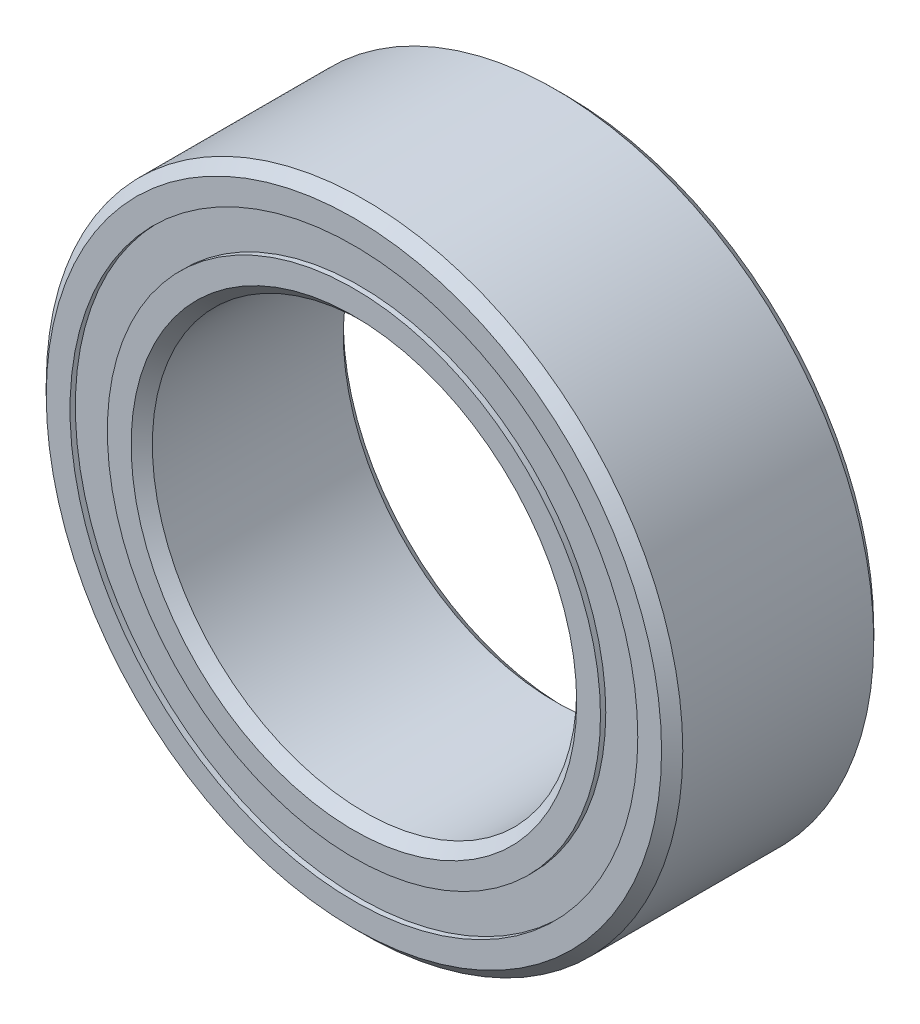
ISO-10303-21;
HEADER;
FILE_DESCRIPTION(('STEP AP214'),'2;1');
FILE_NAME('part.step','',(''),(''),'','','');
FILE_SCHEMA(('AUTOMOTIVE_DESIGN { 1 0 10303 214 1 1 1 1 }'));
ENDSEC;
DATA;
#1=APPLICATION_CONTEXT('core data for automotive mechanical design processes');
#2=APPLICATION_PROTOCOL_DEFINITION('international standard','automotive_design',2000,#1);
#3=PRODUCT_CONTEXT('',#1,'mechanical');
#4=PRODUCT('Part','Part','',(#3));
#5=PRODUCT_RELATED_PRODUCT_CATEGORY('part','',(#4));
#6=PRODUCT_DEFINITION_FORMATION('','',#4);
#7=PRODUCT_DEFINITION_CONTEXT('part definition',#1,'design');
#8=PRODUCT_DEFINITION('design','',#6,#7);
#9=PRODUCT_DEFINITION_SHAPE('','',#8);
#10=(LENGTH_UNIT() NAMED_UNIT(*) SI_UNIT(.MILLI.,.METRE.));
#11=(NAMED_UNIT(*) PLANE_ANGLE_UNIT() SI_UNIT($,.RADIAN.));
#12=(NAMED_UNIT(*) SI_UNIT($,.STERADIAN.) SOLID_ANGLE_UNIT());
#13=UNCERTAINTY_MEASURE_WITH_UNIT(LENGTH_MEASURE(1.E-05),#10,'distance_accuracy_value','');
#14=(GEOMETRIC_REPRESENTATION_CONTEXT(3) GLOBAL_UNCERTAINTY_ASSIGNED_CONTEXT((#13)) GLOBAL_UNIT_ASSIGNED_CONTEXT((#10,
#11,#12)) REPRESENTATION_CONTEXT('',''));
#15=CARTESIAN_POINT('',(0.,0.,0.));
#16=DIRECTION('',(0.,0.,1.));
#17=DIRECTION('',(1.,0.,0.));
#18=AXIS2_PLACEMENT_3D('',#15,#16,#17);
#19=CARTESIAN_POINT('',(0.,4.24787087912088,-1.508125));
#20=DIRECTION('',(0.,0.,1.));
#21=DIRECTION('',(1.,0.,0.));
#22=AXIS2_PLACEMENT_3D('',#19,#20,#21);
#23=PLANE('',#22);
#24=CARTESIAN_POINT('',(0.,0.,-1.508125));
#25=DIRECTION('',(0.,0.,1.));
#26=DIRECTION('',(1.,0.,0.));
#27=AXIS2_PLACEMENT_3D('',#24,#25,#26);
#28=CIRCLE('',#27,3.68962912087912);
#29=CARTESIAN_POINT('',(3.68962912087912,0.,-1.508125));
#30=VERTEX_POINT('',#29);
#31=EDGE_CURVE('P0_E17',#30,#30,#28,.T.);
#32=ORIENTED_EDGE('',*,*,#31,.T.);
#33=EDGE_LOOP('',(#32));
#34=FACE_BOUND('',#33,.T.);
#35=CARTESIAN_POINT('',(0.,0.,-1.508125));
#36=DIRECTION('',(0.,0.,1.));
#37=DIRECTION('',(1.,0.,0.));
#38=AXIS2_PLACEMENT_3D('',#35,#36,#37);
#39=CIRCLE('',#38,4.24787087912088);
#40=CARTESIAN_POINT('',(4.24787087912088,0.,-1.508125));
#41=VERTEX_POINT('',#40);
#42=EDGE_CURVE('P0_E26',#41,#41,#39,.T.);
#43=ORIENTED_EDGE('',*,*,#42,.F.);
#44=EDGE_LOOP('',(#43));
#45=FACE_BOUND('',#44,.T.);
#46=ADVANCED_FACE('P0_F14',(#34,#45),#23,.F.);
#47=CARTESIAN_POINT('',(0.,0.,1.5875));
#48=DIRECTION('',(0.,0.,1.));
#49=DIRECTION('',(1.,0.,0.));
#50=AXIS2_PLACEMENT_3D('',#47,#48,#49);
#51=CYLINDRICAL_SURFACE('',#50,3.68962912087912);
#52=ORIENTED_EDGE('',*,*,#31,.F.);
#53=EDGE_LOOP('',(#52));
#54=FACE_BOUND('',#53,.T.);
#55=CARTESIAN_POINT('',(0.,0.,-0.758760243513405));
#56=DIRECTION('',(0.,0.,1.));
#57=DIRECTION('',(1.,0.,0.));
#58=AXIS2_PLACEMENT_3D('',#55,#56,#57);
#59=CIRCLE('',#58,3.68962912087912);
#60=CARTESIAN_POINT('',(3.68962912087912,0.,-0.758760243513405));
#61=VERTEX_POINT('',#60);
#62=EDGE_CURVE('P0_E21',#61,#61,#59,.T.);
#63=ORIENTED_EDGE('',*,*,#62,.T.);
#64=EDGE_LOOP('',(#63));
#65=FACE_BOUND('',#64,.T.);
#66=ADVANCED_FACE('P0_F36',(#54,#65),#51,.F.);
#67=CARTESIAN_POINT('',(0.,0.,1.5875));
#68=DIRECTION('',(0.,0.,1.));
#69=DIRECTION('',(1.,0.,0.));
#70=AXIS2_PLACEMENT_3D('',#67,#68,#69);
#71=CYLINDRICAL_SURFACE('',#70,4.24787087912088);
#72=CARTESIAN_POINT('',(0.,0.,-0.758760243513404));
#73=DIRECTION('',(0.,0.,1.));
#74=DIRECTION('',(1.,0.,0.));
#75=AXIS2_PLACEMENT_3D('',#72,#73,#74);
#76=CIRCLE('',#75,4.24787087912088);
#77=CARTESIAN_POINT('',(4.24787087912088,0.,-0.758760243513404));
#78=VERTEX_POINT('',#77);
#79=EDGE_CURVE('P0_E10',#78,#78,#76,.F.);
#80=ORIENTED_EDGE('',*,*,#79,.T.);
#81=EDGE_LOOP('',(#80));
#82=FACE_BOUND('',#81,.T.);
#83=ORIENTED_EDGE('',*,*,#42,.T.);
#84=EDGE_LOOP('',(#83));
#85=FACE_BOUND('',#84,.T.);
#86=ADVANCED_FACE('P0_F39',(#82,#85),#71,.T.);
#87=CARTESIAN_POINT('',(0.,4.24787087912088,-0.758760243513404));
#88=DIRECTION('',(0.,0.,-1.));
#89=DIRECTION('',(-1.,0.,0.));
#90=AXIS2_PLACEMENT_3D('',#87,#88,#89);
#91=PLANE('',#90);
#92=ORIENTED_EDGE('',*,*,#79,.F.);
#93=EDGE_LOOP('',(#92));
#94=FACE_BOUND('',#93,.T.);
#95=ORIENTED_EDGE('',*,*,#62,.F.);
#96=EDGE_LOOP('',(#95));
#97=FACE_BOUND('',#96,.T.);
#98=ADVANCED_FACE('P0_F42',(#94,#97),#91,.F.);
#99=CLOSED_SHELL('',(#46,#66,#86,#98));
#100=MANIFOLD_SOLID_BREP('P0_B1',#99);
#101=CARTESIAN_POINT('',(0.,3.96875,0.));
#102=DIRECTION('',(0.,1.,0.));
#103=DIRECTION('',(0.,0.,-1.));
#104=AXIS2_PLACEMENT_3D('',#101,#102,#103);
#105=SPHERICAL_SURFACE('',#104,0.758760243513404);
#106=CARTESIAN_POINT('',(0.,3.2099897564866,0.));
#107=VERTEX_POINT('',#106);
#108=VERTEX_LOOP('',#107);
#109=FACE_BOUND('',#108,.T.);
#110=CARTESIAN_POINT('',(0.,4.7275102435134,0.));
#111=VERTEX_POINT('',#110);
#112=VERTEX_LOOP('',#111);
#113=FACE_BOUND('',#112,.T.);
#114=ADVANCED_FACE('P1_F15',(#109,#113),#105,.T.);
#115=CLOSED_SHELL('',(#114));
#116=MANIFOLD_SOLID_BREP('P1_B1',#115);
#117=CARTESIAN_POINT('',(0.,-3.96875,0.));
#118=DIRECTION('',(0.,-1.,0.));
#119=DIRECTION('',(0.,0.,-1.));
#120=AXIS2_PLACEMENT_3D('',#117,#118,#119);
#121=SPHERICAL_SURFACE('',#120,0.758760243513404);
#122=CARTESIAN_POINT('',(0.,-3.2099897564866,0.));
#123=VERTEX_POINT('',#122);
#124=VERTEX_LOOP('',#123);
#125=FACE_BOUND('',#124,.T.);
#126=CARTESIAN_POINT('',(0.,-4.7275102435134,0.));
#127=VERTEX_POINT('',#126);
#128=VERTEX_LOOP('',#127);
#129=FACE_BOUND('',#128,.T.);
#130=ADVANCED_FACE('P2_F15',(#125,#129),#121,.T.);
#131=CLOSED_SHELL('',(#130));
#132=MANIFOLD_SOLID_BREP('P2_B1',#131);
#133=CARTESIAN_POINT('',(-3.43703832126947,1.98437500000004,0.));
#134=DIRECTION('',(-0.866025403784433,0.50000000000001,0.));
#135=DIRECTION('',(0.,0.,-1.));
#136=AXIS2_PLACEMENT_3D('',#133,#134,#135);
#137=SPHERICAL_SURFACE('',#136,0.758760243513404);
#138=CARTESIAN_POINT('',(-2.7799326750052,1.60499487824333,0.));
#139=VERTEX_POINT('',#138);
#140=VERTEX_LOOP('',#139);
#141=FACE_BOUND('',#140,.T.);
#142=CARTESIAN_POINT('',(-4.09414396753374,2.36375512175675,0.));
#143=VERTEX_POINT('',#142);
#144=VERTEX_LOOP('',#143);
#145=FACE_BOUND('',#144,.T.);
#146=ADVANCED_FACE('P3_F15',(#141,#145),#137,.T.);
#147=CLOSED_SHELL('',(#146));
#148=MANIFOLD_SOLID_BREP('P3_B1',#147);
#149=CARTESIAN_POINT('',(3.43703832126948,-1.98437500000002,0.));
#150=DIRECTION('',(0.866025403784437,-0.500000000000004,0.));
#151=DIRECTION('',(0.,0.,-1.));
#152=AXIS2_PLACEMENT_3D('',#149,#150,#151);
#153=SPHERICAL_SURFACE('',#152,0.758760243513404);
#154=CARTESIAN_POINT('',(4.09414396753376,-2.36375512175672,0.));
#155=VERTEX_POINT('',#154);
#156=VERTEX_LOOP('',#155);
#157=FACE_BOUND('',#156,.T.);
#158=CARTESIAN_POINT('',(2.77993267500521,-1.60499487824331,0.));
#159=VERTEX_POINT('',#158);
#160=VERTEX_LOOP('',#159);
#161=FACE_BOUND('',#160,.T.);
#162=ADVANCED_FACE('P4_F15',(#157,#161),#153,.T.);
#163=CLOSED_SHELL('',(#162));
#164=MANIFOLD_SOLID_BREP('P4_B1',#163);
#165=CARTESIAN_POINT('',(3.96875,0.,0.));
#166=DIRECTION('',(1.,0.,0.));
#167=DIRECTION('',(0.,0.,-1.));
#168=AXIS2_PLACEMENT_3D('',#165,#166,#167);
#169=SPHERICAL_SURFACE('',#168,0.758760243513404);
#170=CARTESIAN_POINT('',(3.2099897564866,0.,0.));
#171=VERTEX_POINT('',#170);
#172=VERTEX_LOOP('',#171);
#173=FACE_BOUND('',#172,.T.);
#174=CARTESIAN_POINT('',(4.7275102435134,0.,0.));
#175=VERTEX_POINT('',#174);
#176=VERTEX_LOOP('',#175);
#177=FACE_BOUND('',#176,.T.);
#178=ADVANCED_FACE('P5_F15',(#173,#177),#169,.T.);
#179=CLOSED_SHELL('',(#178));
#180=MANIFOLD_SOLID_BREP('P5_B1',#179);
#181=CARTESIAN_POINT('',(-1.98437500000003,-3.43703832126947,0.));
#182=DIRECTION('',(-0.500000000000007,-0.866025403784435,0.));
#183=DIRECTION('',(0.,0.,-1.));
#184=AXIS2_PLACEMENT_3D('',#181,#182,#183);
#185=SPHERICAL_SURFACE('',#184,0.758760243513404);
#186=CARTESIAN_POINT('',(-1.60499487824332,-2.7799326750052,0.));
#187=VERTEX_POINT('',#186);
#188=VERTEX_LOOP('',#187);
#189=FACE_BOUND('',#188,.T.);
#190=CARTESIAN_POINT('',(-2.36375512175674,-4.09414396753375,0.));
#191=VERTEX_POINT('',#190);
#192=VERTEX_LOOP('',#191);
#193=FACE_BOUND('',#192,.T.);
#194=ADVANCED_FACE('P6_F15',(#189,#193),#185,.T.);
#195=CLOSED_SHELL('',(#194));
#196=MANIFOLD_SOLID_BREP('P6_B1',#195);
#197=CARTESIAN_POINT('',(0.,4.24787087912088,0.758760243513404));
#198=DIRECTION('',(0.,0.,1.));
#199=DIRECTION('',(1.,0.,0.));
#200=AXIS2_PLACEMENT_3D('',#197,#198,#199);
#201=PLANE('',#200);
#202=CARTESIAN_POINT('',(0.,0.,0.758760243513404));
#203=DIRECTION('',(0.,0.,1.));
#204=DIRECTION('',(1.,0.,0.));
#205=AXIS2_PLACEMENT_3D('',#202,#203,#204);
#206=CIRCLE('',#205,3.68962912087912);
#207=CARTESIAN_POINT('',(3.68962912087912,0.,0.758760243513404));
#208=VERTEX_POINT('',#207);
#209=EDGE_CURVE('P7_E17',#208,#208,#206,.T.);
#210=ORIENTED_EDGE('',*,*,#209,.T.);
#211=EDGE_LOOP('',(#210));
#212=FACE_BOUND('',#211,.T.);
#213=CARTESIAN_POINT('',(0.,0.,0.758760243513404));
#214=DIRECTION('',(0.,0.,1.));
#215=DIRECTION('',(1.,0.,0.));
#216=AXIS2_PLACEMENT_3D('',#213,#214,#215);
#217=CIRCLE('',#216,4.24787087912088);
#218=CARTESIAN_POINT('',(4.24787087912088,0.,0.758760243513404));
#219=VERTEX_POINT('',#218);
#220=EDGE_CURVE('P7_E26',#219,#219,#217,.T.);
#221=ORIENTED_EDGE('',*,*,#220,.F.);
#222=EDGE_LOOP('',(#221));
#223=FACE_BOUND('',#222,.T.);
#224=ADVANCED_FACE('P7_F14',(#212,#223),#201,.F.);
#225=CARTESIAN_POINT('',(0.,0.,1.5875));
#226=DIRECTION('',(0.,0.,1.));
#227=DIRECTION('',(1.,0.,0.));
#228=AXIS2_PLACEMENT_3D('',#225,#226,#227);
#229=CYLINDRICAL_SURFACE('',#228,3.68962912087912);
#230=ORIENTED_EDGE('',*,*,#209,.F.);
#231=EDGE_LOOP('',(#230));
#232=FACE_BOUND('',#231,.T.);
#233=CARTESIAN_POINT('',(0.,0.,1.508125));
#234=DIRECTION('',(0.,0.,1.));
#235=DIRECTION('',(1.,0.,0.));
#236=AXIS2_PLACEMENT_3D('',#233,#234,#235);
#237=CIRCLE('',#236,3.68962912087912);
#238=CARTESIAN_POINT('',(3.68962912087912,0.,1.508125));
#239=VERTEX_POINT('',#238);
#240=EDGE_CURVE('P7_E21',#239,#239,#237,.T.);
#241=ORIENTED_EDGE('',*,*,#240,.T.);
#242=EDGE_LOOP('',(#241));
#243=FACE_BOUND('',#242,.T.);
#244=ADVANCED_FACE('P7_F36',(#232,#243),#229,.F.);
#245=CARTESIAN_POINT('',(0.,0.,1.5875));
#246=DIRECTION('',(0.,0.,1.));
#247=DIRECTION('',(1.,0.,0.));
#248=AXIS2_PLACEMENT_3D('',#245,#246,#247);
#249=CYLINDRICAL_SURFACE('',#248,4.24787087912088);
#250=CARTESIAN_POINT('',(0.,0.,1.508125));
#251=DIRECTION('',(0.,0.,1.));
#252=DIRECTION('',(1.,0.,0.));
#253=AXIS2_PLACEMENT_3D('',#250,#251,#252);
#254=CIRCLE('',#253,4.24787087912088);
#255=CARTESIAN_POINT('',(4.24787087912088,0.,1.508125));
#256=VERTEX_POINT('',#255);
#257=EDGE_CURVE('P7_E10',#256,#256,#254,.F.);
#258=ORIENTED_EDGE('',*,*,#257,.T.);
#259=EDGE_LOOP('',(#258));
#260=FACE_BOUND('',#259,.T.);
#261=ORIENTED_EDGE('',*,*,#220,.T.);
#262=EDGE_LOOP('',(#261));
#263=FACE_BOUND('',#262,.T.);
#264=ADVANCED_FACE('P7_F39',(#260,#263),#249,.T.);
#265=CARTESIAN_POINT('',(0.,4.24787087912088,1.508125));
#266=DIRECTION('',(0.,0.,-1.));
#267=DIRECTION('',(-1.,0.,0.));
#268=AXIS2_PLACEMENT_3D('',#265,#266,#267);
#269=PLANE('',#268);
#270=ORIENTED_EDGE('',*,*,#257,.F.);
#271=EDGE_LOOP('',(#270));
#272=FACE_BOUND('',#271,.T.);
#273=ORIENTED_EDGE('',*,*,#240,.F.);
#274=EDGE_LOOP('',(#273));
#275=FACE_BOUND('',#274,.T.);
#276=ADVANCED_FACE('P7_F42',(#272,#275),#269,.F.);
#277=CLOSED_SHELL('',(#224,#244,#264,#276));
#278=MANIFOLD_SOLID_BREP('P7_B1',#277);
#279=CARTESIAN_POINT('',(-3.43703832126951,-1.98437499999997,0.));
#280=DIRECTION('',(-0.866025403784443,-0.499999999999992,0.));
#281=DIRECTION('',(0.,0.,-1.));
#282=AXIS2_PLACEMENT_3D('',#279,#280,#281);
#283=SPHERICAL_SURFACE('',#282,0.758760243513404);
#284=CARTESIAN_POINT('',(-4.09414396753379,-2.36375512175666,0.));
#285=VERTEX_POINT('',#284);
#286=VERTEX_LOOP('',#285);
#287=FACE_BOUND('',#286,.T.);
#288=CARTESIAN_POINT('',(-2.77993267500523,-1.60499487824327,0.));
#289=VERTEX_POINT('',#288);
#290=VERTEX_LOOP('',#289);
#291=FACE_BOUND('',#290,.T.);
#292=ADVANCED_FACE('P8_F15',(#287,#291),#283,.T.);
#293=CLOSED_SHELL('',(#292));
#294=MANIFOLD_SOLID_BREP('P8_B1',#293);
#295=CARTESIAN_POINT('',(-1.98437499999996,3.43703832126952,0.));
#296=DIRECTION('',(-0.499999999999989,0.866025403784445,0.));
#297=DIRECTION('',(0.,0.,-1.));
#298=AXIS2_PLACEMENT_3D('',#295,#296,#297);
#299=SPHERICAL_SURFACE('',#298,0.758760243513404);
#300=CARTESIAN_POINT('',(-2.36375512175665,4.0941439675338,0.));
#301=VERTEX_POINT('',#300);
#302=VERTEX_LOOP('',#301);
#303=FACE_BOUND('',#302,.T.);
#304=CARTESIAN_POINT('',(-1.60499487824326,2.77993267500524,0.));
#305=VERTEX_POINT('',#304);
#306=VERTEX_LOOP('',#305);
#307=FACE_BOUND('',#306,.T.);
#308=ADVANCED_FACE('P9_F15',(#303,#307),#299,.T.);
#309=CLOSED_SHELL('',(#308));
#310=MANIFOLD_SOLID_BREP('P9_B1',#309);
#311=CARTESIAN_POINT('',(-3.96875,0.,0.));
#312=DIRECTION('',(-1.,0.,0.));
#313=DIRECTION('',(0.,0.,-1.));
#314=AXIS2_PLACEMENT_3D('',#311,#312,#313);
#315=SPHERICAL_SURFACE('',#314,0.758760243513404);
#316=CARTESIAN_POINT('',(-4.7275102435134,0.,0.));
#317=VERTEX_POINT('',#316);
#318=VERTEX_LOOP('',#317);
#319=FACE_BOUND('',#318,.T.);
#320=CARTESIAN_POINT('',(-3.2099897564866,0.,0.));
#321=VERTEX_POINT('',#320);
#322=VERTEX_LOOP('',#321);
#323=FACE_BOUND('',#322,.T.);
#324=ADVANCED_FACE('P10_F15',(#319,#323),#315,.T.);
#325=CLOSED_SHELL('',(#324));
#326=MANIFOLD_SOLID_BREP('P10_B1',#325);
#327=CARTESIAN_POINT('',(0.,0.,0.));
#328=DIRECTION('',(0.,0.,1.));
#329=DIRECTION('',(1.,0.,0.));
#330=AXIS2_PLACEMENT_3D('',#327,#328,#329);
#331=TOROIDAL_SURFACE('',#330,3.96875,0.758760243513404);
#332=CARTESIAN_POINT('',(0.,0.,-0.705555555555556));
#333=DIRECTION('',(0.,0.,1.));
#334=DIRECTION('',(1.,0.,0.));
#335=AXIS2_PLACEMENT_3D('',#332,#333,#334);
#336=CIRCLE('',#335,4.24787087912088);
#337=CARTESIAN_POINT('',(4.24787087912088,0.,-0.705555555555556));
#338=VERTEX_POINT('',#337);
#339=EDGE_CURVE('P11_E32',#338,#338,#336,.F.);
#340=ORIENTED_EDGE('',*,*,#339,.T.);
#341=EDGE_LOOP('',(#340));
#342=FACE_BOUND('',#341,.T.);
#343=CARTESIAN_POINT('',(0.,0.,0.705555555555555));
#344=DIRECTION('',(0.,0.,1.));
#345=DIRECTION('',(1.,0.,0.));
#346=AXIS2_PLACEMENT_3D('',#343,#344,#345);
#347=CIRCLE('',#346,4.24787087912088);
#348=CARTESIAN_POINT('',(4.24787087912088,0.,0.705555555555555));
#349=VERTEX_POINT('',#348);
#350=EDGE_CURVE('P11_E30',#349,#349,#347,.T.);
#351=ORIENTED_EDGE('',*,*,#350,.T.);
#352=EDGE_LOOP('',(#351));
#353=FACE_BOUND('',#352,.T.);
#354=ADVANCED_FACE('P11_F14',(#342,#353),#331,.F.);
#355=CARTESIAN_POINT('',(0.,0.,1.5875));
#356=DIRECTION('',(0.,0.,1.));
#357=DIRECTION('',(1.,0.,0.));
#358=AXIS2_PLACEMENT_3D('',#355,#356,#357);
#359=CYLINDRICAL_SURFACE('',#358,4.24787087912088);
#360=CARTESIAN_POINT('',(0.,0.,-1.5875));
#361=DIRECTION('',(0.,0.,1.));
#362=DIRECTION('',(1.,0.,0.));
#363=AXIS2_PLACEMENT_3D('',#360,#361,#362);
#364=CIRCLE('',#363,4.24787087912088);
#365=CARTESIAN_POINT('',(4.24787087912088,0.,-1.5875));
#366=VERTEX_POINT('',#365);
#367=EDGE_CURVE('P11_E18',#366,#366,#364,.F.);
#368=ORIENTED_EDGE('',*,*,#367,.T.);
#369=EDGE_LOOP('',(#368));
#370=FACE_BOUND('',#369,.T.);
#371=ORIENTED_EDGE('',*,*,#339,.F.);
#372=EDGE_LOOP('',(#371));
#373=FACE_BOUND('',#372,.T.);
#374=ADVANCED_FACE('P11_F48',(#370,#373),#359,.F.);
#375=CARTESIAN_POINT('',(0.,0.,1.5875));
#376=DIRECTION('',(0.,0.,1.));
#377=DIRECTION('',(1.,0.,0.));
#378=AXIS2_PLACEMENT_3D('',#375,#376,#377);
#379=CYLINDRICAL_SURFACE('',#378,4.24787087912088);
#380=ORIENTED_EDGE('',*,*,#350,.F.);
#381=EDGE_LOOP('',(#380));
#382=FACE_BOUND('',#381,.T.);
#383=CARTESIAN_POINT('',(0.,0.,1.5875));
#384=DIRECTION('',(0.,0.,1.));
#385=DIRECTION('',(1.,0.,0.));
#386=AXIS2_PLACEMENT_3D('',#383,#384,#385);
#387=CIRCLE('',#386,4.24787087912088);
#388=CARTESIAN_POINT('',(4.24787087912088,0.,1.5875));
#389=VERTEX_POINT('',#388);
#390=EDGE_CURVE('P11_E41',#389,#389,#387,.T.);
#391=ORIENTED_EDGE('',*,*,#390,.T.);
#392=EDGE_LOOP('',(#391));
#393=FACE_BOUND('',#392,.T.);
#394=ADVANCED_FACE('P11_F55',(#382,#393),#379,.F.);
#395=CARTESIAN_POINT('',(0.,4.60375,-1.5875));
#396=DIRECTION('',(0.,0.,1.));
#397=DIRECTION('',(1.,0.,0.));
#398=AXIS2_PLACEMENT_3D('',#395,#396,#397);
#399=PLANE('',#398);
#400=ORIENTED_EDGE('',*,*,#367,.F.);
#401=EDGE_LOOP('',(#400));
#402=FACE_BOUND('',#401,.T.);
#403=CARTESIAN_POINT('',(0.,0.,-1.58750000002783));
#404=DIRECTION('',(0.,0.,1.));
#405=DIRECTION('',(1.,0.,0.));
#406=AXIS2_PLACEMENT_3D('',#403,#404,#405);
#407=CIRCLE('',#406,4.60375000000113);
#408=CARTESIAN_POINT('',(4.60375000000113,0.,-1.58750000002783));
#409=VERTEX_POINT('',#408);
#410=EDGE_CURVE('P11_E39',#409,#409,#407,.T.);
#411=ORIENTED_EDGE('',*,*,#410,.F.);
#412=EDGE_LOOP('',(#411));
#413=FACE_BOUND('',#412,.T.);
#414=ADVANCED_FACE('P11_F51',(#402,#413),#399,.F.);
#415=CARTESIAN_POINT('',(0.,4.60375,1.5875));
#416=DIRECTION('',(0.,0.,-1.));
#417=DIRECTION('',(-1.,0.,0.));
#418=AXIS2_PLACEMENT_3D('',#415,#416,#417);
#419=PLANE('',#418);
#420=CARTESIAN_POINT('',(0.,0.,1.58750000008467));
#421=DIRECTION('',(0.,0.,-1.));
#422=DIRECTION('',(-1.,0.,0.));
#423=AXIS2_PLACEMENT_3D('',#420,#421,#422);
#424=CIRCLE('',#423,4.60375000000113);
#425=CARTESIAN_POINT('',(-4.60375000000113,0.,1.58750000008467));
#426=VERTEX_POINT('',#425);
#427=EDGE_CURVE('P11_E27',#426,#426,#424,.T.);
#428=ORIENTED_EDGE('',*,*,#427,.F.);
#429=EDGE_LOOP('',(#428));
#430=FACE_BOUND('',#429,.T.);
#431=ORIENTED_EDGE('',*,*,#390,.F.);
#432=EDGE_LOOP('',(#431));
#433=FACE_BOUND('',#432,.T.);
#434=ADVANCED_FACE('P11_F54',(#430,#433),#419,.F.);
#435=CARTESIAN_POINT('',(0.,0.,-1.42874999994547));
#436=DIRECTION('',(0.,0.,1.));
#437=DIRECTION('',(1.,0.,0.));
#438=AXIS2_PLACEMENT_3D('',#435,#436,#437);
#439=CONICAL_SURFACE('',#438,4.76250000002665,0.785398163218414);
#440=CARTESIAN_POINT('',(0.,0.,-1.42875));
#441=DIRECTION('',(0.,0.,1.));
#442=DIRECTION('',(1.,0.,0.));
#443=AXIS2_PLACEMENT_3D('',#440,#441,#442);
#444=CIRCLE('',#443,4.7625);
#445=CARTESIAN_POINT('',(4.7625,0.,-1.42875));
#446=VERTEX_POINT('',#445);
#447=EDGE_CURVE('P11_E22',#446,#446,#444,.T.);
#448=ORIENTED_EDGE('',*,*,#447,.F.);
#449=EDGE_LOOP('',(#448));
#450=FACE_BOUND('',#449,.T.);
#451=ORIENTED_EDGE('',*,*,#410,.T.);
#452=EDGE_LOOP('',(#451));
#453=FACE_BOUND('',#452,.T.);
#454=ADVANCED_FACE('P11_F59',(#450,#453),#439,.T.);
#455=CARTESIAN_POINT('',(0.,0.,1.42875000005915));
#456=DIRECTION('',(0.,0.,-1.));
#457=DIRECTION('',(-1.,0.,0.));
#458=AXIS2_PLACEMENT_3D('',#455,#456,#457);
#459=CONICAL_SURFACE('',#458,4.7624999999698,0.785398163218414);
#460=CARTESIAN_POINT('',(0.,0.,1.42875));
#461=DIRECTION('',(0.,0.,1.));
#462=DIRECTION('',(1.,0.,0.));
#463=AXIS2_PLACEMENT_3D('',#460,#461,#462);
#464=CIRCLE('',#463,4.7625);
#465=CARTESIAN_POINT('',(4.7625,0.,1.42875));
#466=VERTEX_POINT('',#465);
#467=EDGE_CURVE('P11_E10',#466,#466,#464,.F.);
#468=ORIENTED_EDGE('',*,*,#467,.F.);
#469=EDGE_LOOP('',(#468));
#470=FACE_BOUND('',#469,.T.);
#471=ORIENTED_EDGE('',*,*,#427,.T.);
#472=EDGE_LOOP('',(#471));
#473=FACE_BOUND('',#472,.T.);
#474=ADVANCED_FACE('P11_F61',(#470,#473),#459,.T.);
#475=CARTESIAN_POINT('',(0.,0.,1.5875));
#476=DIRECTION('',(0.,0.,1.));
#477=DIRECTION('',(1.,0.,0.));
#478=AXIS2_PLACEMENT_3D('',#475,#476,#477);
#479=CYLINDRICAL_SURFACE('',#478,4.7625);
#480=ORIENTED_EDGE('',*,*,#467,.T.);
#481=EDGE_LOOP('',(#480));
#482=FACE_BOUND('',#481,.T.);
#483=ORIENTED_EDGE('',*,*,#447,.T.);
#484=EDGE_LOOP('',(#483));
#485=FACE_BOUND('',#484,.T.);
#486=ADVANCED_FACE('P11_F69',(#482,#485),#479,.T.);
#487=CLOSED_SHELL('',(#354,#374,#394,#414,#434,#454,#474,#486));
#488=MANIFOLD_SOLID_BREP('P11_B1',#487);
#489=CARTESIAN_POINT('',(1.98437499999998,-3.4370383212695,0.));
#490=DIRECTION('',(0.499999999999995,-0.866025403784442,0.));
#491=DIRECTION('',(0.,0.,-1.));
#492=AXIS2_PLACEMENT_3D('',#489,#490,#491);
#493=SPHERICAL_SURFACE('',#492,0.758760243513404);
#494=CARTESIAN_POINT('',(2.36375512175668,-4.09414396753378,0.));
#495=VERTEX_POINT('',#494);
#496=VERTEX_LOOP('',#495);
#497=FACE_BOUND('',#496,.T.);
#498=CARTESIAN_POINT('',(1.60499487824328,-2.77993267500523,0.));
#499=VERTEX_POINT('',#498);
#500=VERTEX_LOOP('',#499);
#501=FACE_BOUND('',#500,.T.);
#502=ADVANCED_FACE('P12_F15',(#497,#501),#493,.T.);
#503=CLOSED_SHELL('',(#502));
#504=MANIFOLD_SOLID_BREP('P12_B1',#503);
#505=CARTESIAN_POINT('',(0.,0.,0.));
#506=DIRECTION('',(0.,0.,1.));
#507=DIRECTION('',(1.,0.,0.));
#508=AXIS2_PLACEMENT_3D('',#505,#506,#507);
#509=TOROIDAL_SURFACE('',#508,3.96875,0.758760243513403);
#510=CARTESIAN_POINT('',(0.,0.,0.705555555555556));
#511=DIRECTION('',(0.,0.,1.));
#512=DIRECTION('',(1.,0.,0.));
#513=AXIS2_PLACEMENT_3D('',#510,#511,#512);
#514=CIRCLE('',#513,3.68962912087912);
#515=CARTESIAN_POINT('',(3.68962912087912,0.,0.705555555555556));
#516=VERTEX_POINT('',#515);
#517=EDGE_CURVE('P13_E32',#516,#516,#514,.T.);
#518=ORIENTED_EDGE('',*,*,#517,.F.);
#519=EDGE_LOOP('',(#518));
#520=FACE_BOUND('',#519,.T.);
#521=CARTESIAN_POINT('',(0.,0.,-0.705555555555556));
#522=DIRECTION('',(0.,0.,1.));
#523=DIRECTION('',(1.,0.,0.));
#524=AXIS2_PLACEMENT_3D('',#521,#522,#523);
#525=CIRCLE('',#524,3.68962912087912);
#526=CARTESIAN_POINT('',(3.68962912087912,0.,-0.705555555555556));
#527=VERTEX_POINT('',#526);
#528=EDGE_CURVE('P13_E30',#527,#527,#525,.F.);
#529=ORIENTED_EDGE('',*,*,#528,.F.);
#530=EDGE_LOOP('',(#529));
#531=FACE_BOUND('',#530,.T.);
#532=ADVANCED_FACE('P13_F14',(#520,#531),#509,.F.);
#533=CARTESIAN_POINT('',(0.,0.,1.5875));
#534=DIRECTION('',(0.,0.,1.));
#535=DIRECTION('',(1.,0.,0.));
#536=AXIS2_PLACEMENT_3D('',#533,#534,#535);
#537=CYLINDRICAL_SURFACE('',#536,3.68962912087912);
#538=CARTESIAN_POINT('',(0.,0.,1.5875));
#539=DIRECTION('',(0.,0.,1.));
#540=DIRECTION('',(1.,0.,0.));
#541=AXIS2_PLACEMENT_3D('',#538,#539,#540);
#542=CIRCLE('',#541,3.68962912087912);
#543=CARTESIAN_POINT('',(3.68962912087912,0.,1.5875));
#544=VERTEX_POINT('',#543);
#545=EDGE_CURVE('P13_E18',#544,#544,#542,.F.);
#546=ORIENTED_EDGE('',*,*,#545,.T.);
#547=EDGE_LOOP('',(#546));
#548=FACE_BOUND('',#547,.T.);
#549=ORIENTED_EDGE('',*,*,#517,.T.);
#550=EDGE_LOOP('',(#549));
#551=FACE_BOUND('',#550,.T.);
#552=ADVANCED_FACE('P13_F48',(#548,#551),#537,.T.);
#553=CARTESIAN_POINT('',(0.,0.,1.5875));
#554=DIRECTION('',(0.,0.,1.));
#555=DIRECTION('',(1.,0.,0.));
#556=AXIS2_PLACEMENT_3D('',#553,#554,#555);
#557=CYLINDRICAL_SURFACE('',#556,3.68962912087912);
#558=ORIENTED_EDGE('',*,*,#528,.T.);
#559=EDGE_LOOP('',(#558));
#560=FACE_BOUND('',#559,.T.);
#561=CARTESIAN_POINT('',(0.,0.,-1.5875));
#562=DIRECTION('',(0.,0.,1.));
#563=DIRECTION('',(1.,0.,0.));
#564=AXIS2_PLACEMENT_3D('',#561,#562,#563);
#565=CIRCLE('',#564,3.68962912087912);
#566=CARTESIAN_POINT('',(3.68962912087912,0.,-1.5875));
#567=VERTEX_POINT('',#566);
#568=EDGE_CURVE('P13_E41',#567,#567,#565,.T.);
#569=ORIENTED_EDGE('',*,*,#568,.T.);
#570=EDGE_LOOP('',(#569));
#571=FACE_BOUND('',#570,.T.);
#572=ADVANCED_FACE('P13_F55',(#560,#571),#557,.T.);
#573=CARTESIAN_POINT('',(0.,3.68962912087912,1.5875));
#574=DIRECTION('',(0.,0.,-1.));
#575=DIRECTION('',(-1.,0.,0.));
#576=AXIS2_PLACEMENT_3D('',#573,#574,#575);
#577=PLANE('',#576);
#578=ORIENTED_EDGE('',*,*,#545,.F.);
#579=EDGE_LOOP('',(#578));
#580=FACE_BOUND('',#579,.T.);
#581=CARTESIAN_POINT('',(0.,0.,1.58749999997099));
#582=DIRECTION('',(0.,0.,1.));
#583=DIRECTION('',(1.,0.,0.));
#584=AXIS2_PLACEMENT_3D('',#581,#582,#583);
#585=CIRCLE('',#584,3.33374999996749);
#586=CARTESIAN_POINT('',(3.33374999996749,0.,1.58749999997099));
#587=VERTEX_POINT('',#586);
#588=EDGE_CURVE('P13_E39',#587,#587,#585,.F.);
#589=ORIENTED_EDGE('',*,*,#588,.T.);
#590=EDGE_LOOP('',(#589));
#591=FACE_BOUND('',#590,.T.);
#592=ADVANCED_FACE('P13_F51',(#580,#591),#577,.F.);
#593=CARTESIAN_POINT('',(0.,3.33375,-1.5875));
#594=DIRECTION('',(0.,0.,1.));
#595=DIRECTION('',(1.,0.,0.));
#596=AXIS2_PLACEMENT_3D('',#593,#594,#595);
#597=PLANE('',#596);
#598=CARTESIAN_POINT('',(0.,0.,-1.58749999997099));
#599=DIRECTION('',(0.,0.,-1.));
#600=DIRECTION('',(0.,1.,0.));
#601=AXIS2_PLACEMENT_3D('',#598,#599,#600);
#602=CIRCLE('',#601,3.33375000002434);
#603=CARTESIAN_POINT('',(0.,3.33375000002434,-1.58749999997099));
#604=VERTEX_POINT('',#603);
#605=EDGE_CURVE('P13_E27',#604,#604,#602,.F.);
#606=ORIENTED_EDGE('',*,*,#605,.T.);
#607=EDGE_LOOP('',(#606));
#608=FACE_BOUND('',#607,.T.);
#609=ORIENTED_EDGE('',*,*,#568,.F.);
#610=EDGE_LOOP('',(#609));
#611=FACE_BOUND('',#610,.T.);
#612=ADVANCED_FACE('P13_F54',(#608,#611),#597,.F.);
#613=CARTESIAN_POINT('',(0.,0.,1.58749999991414));
#614=DIRECTION('',(0.,0.,1.));
#615=DIRECTION('',(1.,0.,0.));
#616=AXIS2_PLACEMENT_3D('',#613,#614,#615);
#617=CONICAL_SURFACE('',#616,3.33374999991065,0.785398163397448);
#618=ORIENTED_EDGE('',*,*,#588,.F.);
#619=EDGE_LOOP('',(#618));
#620=FACE_BOUND('',#619,.T.);
#621=CARTESIAN_POINT('',(0.,0.,1.42875));
#622=DIRECTION('',(0.,0.,1.));
#623=DIRECTION('',(1.,0.,0.));
#624=AXIS2_PLACEMENT_3D('',#621,#622,#623);
#625=CIRCLE('',#624,3.175);
#626=CARTESIAN_POINT('',(3.175,0.,1.42875));
#627=VERTEX_POINT('',#626);
#628=EDGE_CURVE('P13_E22',#627,#627,#625,.F.);
#629=ORIENTED_EDGE('',*,*,#628,.T.);
#630=EDGE_LOOP('',(#629));
#631=FACE_BOUND('',#630,.T.);
#632=ADVANCED_FACE('P13_F59',(#620,#631),#617,.F.);
#633=CARTESIAN_POINT('',(0.,0.,-1.58749999997099));
#634=DIRECTION('',(0.,0.,-1.));
#635=DIRECTION('',(0.,1.,0.));
#636=AXIS2_PLACEMENT_3D('',#633,#634,#635);
#637=CONICAL_SURFACE('',#636,3.33375000002434,0.785398163397448);
#638=CARTESIAN_POINT('',(0.,0.,-1.42875));
#639=DIRECTION('',(0.,0.,1.));
#640=DIRECTION('',(1.,0.,0.));
#641=AXIS2_PLACEMENT_3D('',#638,#639,#640);
#642=CIRCLE('',#641,3.175);
#643=CARTESIAN_POINT('',(3.175,0.,-1.42875));
#644=VERTEX_POINT('',#643);
#645=EDGE_CURVE('P13_E10',#644,#644,#642,.T.);
#646=ORIENTED_EDGE('',*,*,#645,.T.);
#647=EDGE_LOOP('',(#646));
#648=FACE_BOUND('',#647,.T.);
#649=ORIENTED_EDGE('',*,*,#605,.F.);
#650=EDGE_LOOP('',(#649));
#651=FACE_BOUND('',#650,.T.);
#652=ADVANCED_FACE('P13_F62',(#648,#651),#637,.F.);
#653=CARTESIAN_POINT('',(0.,0.,1.5875));
#654=DIRECTION('',(0.,0.,1.));
#655=DIRECTION('',(1.,0.,0.));
#656=AXIS2_PLACEMENT_3D('',#653,#654,#655);
#657=CYLINDRICAL_SURFACE('',#656,3.175);
#658=ORIENTED_EDGE('',*,*,#628,.F.);
#659=EDGE_LOOP('',(#658));
#660=FACE_BOUND('',#659,.T.);
#661=ORIENTED_EDGE('',*,*,#645,.F.);
#662=EDGE_LOOP('',(#661));
#663=FACE_BOUND('',#662,.T.);
#664=ADVANCED_FACE('P13_F66',(#660,#663),#657,.F.);
#665=CLOSED_SHELL('',(#532,#552,#572,#592,#612,#632,#652,#664));
#666=MANIFOLD_SOLID_BREP('P13_B1',#665);
#667=CARTESIAN_POINT('',(3.4370383212695,1.98437499999999,0.));
#668=DIRECTION('',(0.86602540378444,0.499999999999998,0.));
#669=DIRECTION('',(0.,0.,-1.));
#670=AXIS2_PLACEMENT_3D('',#667,#668,#669);
#671=SPHERICAL_SURFACE('',#670,0.758760243513404);
#672=CARTESIAN_POINT('',(4.09414396753377,2.36375512175669,0.));
#673=VERTEX_POINT('',#672);
#674=VERTEX_LOOP('',#673);
#675=FACE_BOUND('',#674,.T.);
#676=CARTESIAN_POINT('',(2.77993267500522,1.60499487824329,0.));
#677=VERTEX_POINT('',#676);
#678=VERTEX_LOOP('',#677);
#679=FACE_BOUND('',#678,.T.);
#680=ADVANCED_FACE('P14_F15',(#675,#679),#671,.T.);
#681=CLOSED_SHELL('',(#680));
#682=MANIFOLD_SOLID_BREP('P14_B1',#681);
#683=CARTESIAN_POINT('',(1.984375,3.43703832126949,0.));
#684=DIRECTION('',(0.500000000000001,0.866025403784438,0.));
#685=DIRECTION('',(0.,0.,-1.));
#686=AXIS2_PLACEMENT_3D('',#683,#684,#685);
#687=SPHERICAL_SURFACE('',#686,0.758760243513404);
#688=CARTESIAN_POINT('',(2.36375512175671,4.09414396753376,0.));
#689=VERTEX_POINT('',#688);
#690=VERTEX_LOOP('',#689);
#691=FACE_BOUND('',#690,.T.);
#692=CARTESIAN_POINT('',(1.6049948782433,2.77993267500521,0.));
#693=VERTEX_POINT('',#692);
#694=VERTEX_LOOP('',#693);
#695=FACE_BOUND('',#694,.T.);
#696=ADVANCED_FACE('P15_F15',(#691,#695),#687,.T.);
#697=CLOSED_SHELL('',(#696));
#698=MANIFOLD_SOLID_BREP('P15_B1',#697);
#699=ADVANCED_BREP_SHAPE_REPRESENTATION('',(#18,#100,#116,#132,#148,#164,#180,#196,#278,#294,
#310,#326,#488,#504,#666,#682,#698),#14);
#700=SHAPE_DEFINITION_REPRESENTATION(#9,#699);
ENDSEC;
END-ISO-10303-21;
